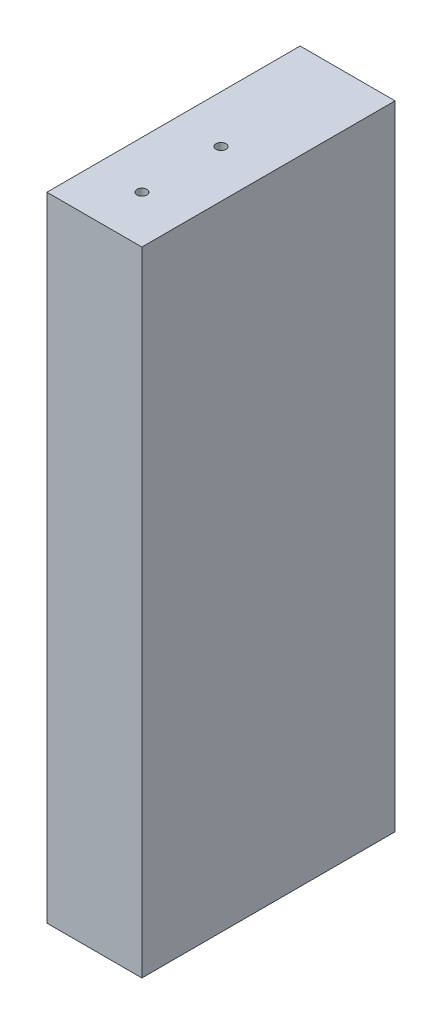
ISO-10303-21;
HEADER;
FILE_DESCRIPTION(('STEP AP214'),'2;1');
FILE_NAME('part.step','',(''),(''),'','','');
FILE_SCHEMA(('AUTOMOTIVE_DESIGN { 1 0 10303 214 1 1 1 1 }'));
ENDSEC;
DATA;
#1=APPLICATION_CONTEXT('core data for automotive mechanical design processes');
#2=APPLICATION_PROTOCOL_DEFINITION('international standard','automotive_design',2000,#1);
#3=PRODUCT_CONTEXT('',#1,'mechanical');
#4=PRODUCT('Part','Part','',(#3));
#5=PRODUCT_RELATED_PRODUCT_CATEGORY('part','',(#4));
#6=PRODUCT_DEFINITION_FORMATION('','',#4);
#7=PRODUCT_DEFINITION_CONTEXT('part definition',#1,'design');
#8=PRODUCT_DEFINITION('design','',#6,#7);
#9=PRODUCT_DEFINITION_SHAPE('','',#8);
#10=(LENGTH_UNIT() NAMED_UNIT(*) SI_UNIT(.MILLI.,.METRE.));
#11=(NAMED_UNIT(*) PLANE_ANGLE_UNIT() SI_UNIT($,.RADIAN.));
#12=(NAMED_UNIT(*) SI_UNIT($,.STERADIAN.) SOLID_ANGLE_UNIT());
#13=UNCERTAINTY_MEASURE_WITH_UNIT(LENGTH_MEASURE(1.E-05),#10,'distance_accuracy_value','');
#14=(GEOMETRIC_REPRESENTATION_CONTEXT(3) GLOBAL_UNCERTAINTY_ASSIGNED_CONTEXT((#13)) GLOBAL_UNIT_ASSIGNED_CONTEXT((#10,
#11,#12)) REPRESENTATION_CONTEXT('',''));
#15=CARTESIAN_POINT('',(0.,0.,0.));
#16=DIRECTION('',(0.,0.,1.));
#17=DIRECTION('',(1.,0.,0.));
#18=AXIS2_PLACEMENT_3D('',#15,#16,#17);
#19=CARTESIAN_POINT('',(386.66968064743,5942.63481881936,50.8));
#20=DIRECTION('',(-1.,0.,0.));
#21=DIRECTION('',(0.,0.,1.));
#22=AXIS2_PLACEMENT_3D('',#19,#20,#21);
#23=PLANE('',#22);
#24=DIRECTION('',(0.,1.,0.));
#25=VECTOR('',#24,1.);
#26=CARTESIAN_POINT('',(386.66968064743,5942.63481881936,0.));
#27=LINE('',#26,#25);
#28=CARTESIAN_POINT('',(386.66968064743,5942.63481881936,0.));
#29=VERTEX_POINT('',#28);
#30=CARTESIAN_POINT('',(386.66968064743,6069.63481870705,0.));
#31=VERTEX_POINT('',#30);
#32=EDGE_CURVE('E147',#29,#31,#27,.T.);
#33=ORIENTED_EDGE('',*,*,#32,.T.);
#34=DIRECTION('',(0.,0.,-1.));
#35=VECTOR('',#34,1.);
#36=CARTESIAN_POINT('',(386.66968064743,6069.63481870705,50.8));
#37=LINE('',#36,#35);
#38=CARTESIAN_POINT('',(386.66968064743,6069.63481870705,50.8));
#39=VERTEX_POINT('',#38);
#40=EDGE_CURVE('E11',#39,#31,#37,.T.);
#41=ORIENTED_EDGE('',*,*,#40,.F.);
#42=DIRECTION('',(0.,1.,0.));
#43=VECTOR('',#42,1.);
#44=CARTESIAN_POINT('',(386.66968064743,5942.63481881936,50.8));
#45=LINE('',#44,#43);
#46=CARTESIAN_POINT('',(386.66968064743,5942.63481881936,50.8));
#47=VERTEX_POINT('',#46);
#48=EDGE_CURVE('E140',#47,#39,#45,.T.);
#49=ORIENTED_EDGE('',*,*,#48,.F.);
#50=DIRECTION('',(0.,0.,-1.));
#51=VECTOR('',#50,1.);
#52=CARTESIAN_POINT('',(386.66968064743,5942.63481881936,50.8));
#53=LINE('',#52,#51);
#54=EDGE_CURVE('E146',#47,#29,#53,.T.);
#55=ORIENTED_EDGE('',*,*,#54,.T.);
#56=EDGE_LOOP('',(#33,#41,#49,#55));
#57=FACE_BOUND('',#56,.T.);
#58=ADVANCED_FACE('F32',(#57),#23,.F.);
#59=CARTESIAN_POINT('',(386.66968064743,6069.63481870705,50.8));
#60=DIRECTION('',(0.,-1.,0.));
#61=DIRECTION('',(0.,0.,-1.));
#62=AXIS2_PLACEMENT_3D('',#59,#60,#61);
#63=PLANE('',#62);
#64=CARTESIAN_POINT('',(377.144680647431,6069.63481870705,41.2749979606772));
#65=DIRECTION('',(0.,1.,0.));
#66=DIRECTION('',(0.,0.,1.));
#67=AXIS2_PLACEMENT_3D('',#64,#65,#66);
#68=CIRCLE('',#67,0.992251);
#69=CARTESIAN_POINT('',(377.144680647431,6069.63481870705,42.2672489606772));
#70=VERTEX_POINT('',#69);
#71=EDGE_CURVE('E111',#70,#70,#68,.T.);
#72=ORIENTED_EDGE('',*,*,#71,.F.);
#73=EDGE_LOOP('',(#72));
#74=FACE_BOUND('',#73,.T.);
#75=CARTESIAN_POINT('',(377.144680647431,6069.63481870705,25.3999979606774));
#76=DIRECTION('',(0.,1.,0.));
#77=DIRECTION('',(0.,0.,1.));
#78=AXIS2_PLACEMENT_3D('',#75,#76,#77);
#79=CIRCLE('',#78,0.992251);
#80=CARTESIAN_POINT('',(377.144680647431,6069.63481870705,26.3922489606774));
#81=VERTEX_POINT('',#80);
#82=EDGE_CURVE('E110',#81,#81,#79,.T.);
#83=ORIENTED_EDGE('',*,*,#82,.F.);
#84=EDGE_LOOP('',(#83));
#85=FACE_BOUND('',#84,.T.);
#86=DIRECTION('',(-1.,0.,0.));
#87=VECTOR('',#86,1.);
#88=CARTESIAN_POINT('',(386.66968064743,6069.63481870705,0.));
#89=LINE('',#88,#87);
#90=CARTESIAN_POINT('',(367.61968064743,6069.63481870705,0.));
#91=VERTEX_POINT('',#90);
#92=EDGE_CURVE('E150',#31,#91,#89,.T.);
#93=ORIENTED_EDGE('',*,*,#92,.T.);
#94=DIRECTION('',(0.,0.,-1.));
#95=VECTOR('',#94,1.);
#96=CARTESIAN_POINT('',(367.61968064743,6069.63481870705,50.8));
#97=LINE('',#96,#95);
#98=CARTESIAN_POINT('',(367.61968064743,6069.63481870705,50.8));
#99=VERTEX_POINT('',#98);
#100=EDGE_CURVE('E41',#99,#91,#97,.T.);
#101=ORIENTED_EDGE('',*,*,#100,.F.);
#102=DIRECTION('',(-1.,0.,0.));
#103=VECTOR('',#102,1.);
#104=CARTESIAN_POINT('',(386.66968064743,6069.63481870705,50.8));
#105=LINE('',#104,#103);
#106=EDGE_CURVE('E81',#39,#99,#105,.T.);
#107=ORIENTED_EDGE('',*,*,#106,.F.);
#108=ORIENTED_EDGE('',*,*,#40,.T.);
#109=EDGE_LOOP('',(#93,#101,#107,#108));
#110=FACE_BOUND('',#109,.T.);
#111=ADVANCED_FACE('F181',(#74,#85,#110),#63,.F.);
#112=CARTESIAN_POINT('',(367.61968064743,5942.63481881936,50.8));
#113=DIRECTION('',(1.,0.,0.));
#114=DIRECTION('',(0.,0.,-1.));
#115=AXIS2_PLACEMENT_3D('',#112,#113,#114);
#116=PLANE('',#115);
#117=DIRECTION('',(0.,-1.,0.));
#118=VECTOR('',#117,1.);
#119=CARTESIAN_POINT('',(367.61968064743,5942.63481881936,0.));
#120=LINE('',#119,#118);
#121=CARTESIAN_POINT('',(367.61968064743,5942.63481881936,0.));
#122=VERTEX_POINT('',#121);
#123=EDGE_CURVE('E68',#91,#122,#120,.T.);
#124=ORIENTED_EDGE('',*,*,#123,.T.);
#125=DIRECTION('',(0.,0.,-1.));
#126=VECTOR('',#125,1.);
#127=CARTESIAN_POINT('',(367.61968064743,5942.63481881936,50.8));
#128=LINE('',#127,#126);
#129=CARTESIAN_POINT('',(367.61968064743,5942.63481881936,50.8));
#130=VERTEX_POINT('',#129);
#131=EDGE_CURVE('E155',#130,#122,#128,.T.);
#132=ORIENTED_EDGE('',*,*,#131,.F.);
#133=DIRECTION('',(0.,-1.,0.));
#134=VECTOR('',#133,1.);
#135=CARTESIAN_POINT('',(367.61968064743,5942.63481881936,50.8));
#136=LINE('',#135,#134);
#137=EDGE_CURVE('E143',#99,#130,#136,.T.);
#138=ORIENTED_EDGE('',*,*,#137,.F.);
#139=ORIENTED_EDGE('',*,*,#100,.T.);
#140=EDGE_LOOP('',(#124,#132,#138,#139));
#141=FACE_BOUND('',#140,.T.);
#142=ADVANCED_FACE('F186',(#141),#116,.F.);
#143=CARTESIAN_POINT('',(386.66968064743,5942.63481881936,50.8));
#144=DIRECTION('',(0.,1.,0.));
#145=DIRECTION('',(0.,0.,1.));
#146=AXIS2_PLACEMENT_3D('',#143,#144,#145);
#147=PLANE('',#146);
#148=CARTESIAN_POINT('',(377.144680647431,5942.63481881936,41.2749979606772));
#149=DIRECTION('',(0.,-1.,0.));
#150=DIRECTION('',(0.,0.,-1.));
#151=AXIS2_PLACEMENT_3D('',#148,#149,#150);
#152=CIRCLE('',#151,0.992251);
#153=CARTESIAN_POINT('',(377.144680647431,5942.63481881936,40.2827469606772));
#154=VERTEX_POINT('',#153);
#155=EDGE_CURVE('E121',#154,#154,#152,.T.);
#156=ORIENTED_EDGE('',*,*,#155,.F.);
#157=EDGE_LOOP('',(#156));
#158=FACE_BOUND('',#157,.T.);
#159=CARTESIAN_POINT('',(377.144680647431,5942.63481881936,25.3999979606774));
#160=DIRECTION('',(0.,-1.,0.));
#161=DIRECTION('',(0.,0.,-1.));
#162=AXIS2_PLACEMENT_3D('',#159,#160,#161);
#163=CIRCLE('',#162,0.992251);
#164=CARTESIAN_POINT('',(377.144680647431,5942.63481881936,24.4077469606774));
#165=VERTEX_POINT('',#164);
#166=EDGE_CURVE('E127',#165,#165,#163,.T.);
#167=ORIENTED_EDGE('',*,*,#166,.F.);
#168=EDGE_LOOP('',(#167));
#169=FACE_BOUND('',#168,.T.);
#170=DIRECTION('',(1.,0.,0.));
#171=VECTOR('',#170,1.);
#172=CARTESIAN_POINT('',(386.66968064743,5942.63481881936,0.));
#173=LINE('',#172,#171);
#174=EDGE_CURVE('E74',#122,#29,#173,.T.);
#175=ORIENTED_EDGE('',*,*,#174,.T.);
#176=ORIENTED_EDGE('',*,*,#54,.F.);
#177=DIRECTION('',(1.,0.,0.));
#178=VECTOR('',#177,1.);
#179=CARTESIAN_POINT('',(386.66968064743,5942.63481881936,50.8));
#180=LINE('',#179,#178);
#181=EDGE_CURVE('E50',#130,#47,#180,.T.);
#182=ORIENTED_EDGE('',*,*,#181,.F.);
#183=ORIENTED_EDGE('',*,*,#131,.T.);
#184=EDGE_LOOP('',(#175,#176,#182,#183));
#185=FACE_BOUND('',#184,.T.);
#186=ADVANCED_FACE('F193',(#158,#169,#185),#147,.F.);
#187=CARTESIAN_POINT('',(0.,0.,50.8));
#188=DIRECTION('',(0.,0.,1.));
#189=DIRECTION('',(1.,0.,0.));
#190=AXIS2_PLACEMENT_3D('',#187,#188,#189);
#191=PLANE('',#190);
#192=ORIENTED_EDGE('',*,*,#48,.T.);
#193=ORIENTED_EDGE('',*,*,#106,.T.);
#194=ORIENTED_EDGE('',*,*,#137,.T.);
#195=ORIENTED_EDGE('',*,*,#181,.T.);
#196=EDGE_LOOP('',(#192,#193,#194,#195));
#197=FACE_BOUND('',#196,.T.);
#198=ADVANCED_FACE('F175',(#197),#191,.T.);
#199=CARTESIAN_POINT('',(0.,0.,0.));
#200=DIRECTION('',(0.,0.,1.));
#201=DIRECTION('',(1.,0.,0.));
#202=AXIS2_PLACEMENT_3D('',#199,#200,#201);
#203=PLANE('',#202);
#204=CARTESIAN_POINT('',(377.14468064743,6044.23481876321,0.));
#205=DIRECTION('',(0.,0.,1.));
#206=DIRECTION('',(1.,0.,0.));
#207=AXIS2_PLACEMENT_3D('',#204,#205,#206);
#208=CIRCLE('',#207,0.992251);
#209=CARTESIAN_POINT('',(378.13693164743,6044.23481876321,0.));
#210=VERTEX_POINT('',#209);
#211=EDGE_CURVE('E35',#210,#210,#208,.T.);
#212=ORIENTED_EDGE('',*,*,#211,.T.);
#213=EDGE_LOOP('',(#212));
#214=FACE_BOUND('',#213,.T.);
#215=CARTESIAN_POINT('',(377.14468064743,5968.03481876321,0.));
#216=DIRECTION('',(0.,0.,1.));
#217=DIRECTION('',(1.,0.,0.));
#218=AXIS2_PLACEMENT_3D('',#215,#216,#217);
#219=CIRCLE('',#218,0.992251);
#220=CARTESIAN_POINT('',(378.13693164743,5968.03481876321,0.));
#221=VERTEX_POINT('',#220);
#222=EDGE_CURVE('E139',#221,#221,#219,.T.);
#223=ORIENTED_EDGE('',*,*,#222,.T.);
#224=EDGE_LOOP('',(#223));
#225=FACE_BOUND('',#224,.T.);
#226=ORIENTED_EDGE('',*,*,#32,.F.);
#227=ORIENTED_EDGE('',*,*,#174,.F.);
#228=ORIENTED_EDGE('',*,*,#123,.F.);
#229=ORIENTED_EDGE('',*,*,#92,.F.);
#230=EDGE_LOOP('',(#226,#227,#228,#229));
#231=FACE_BOUND('',#230,.T.);
#232=ADVANCED_FACE('F160',(#214,#225,#231),#203,.F.);
#233=CARTESIAN_POINT('',(377.14468064743,5968.03481876583,-19.0500867729428));
#234=DIRECTION('',(0.,1.37705073334418E-10,-1.));
#235=DIRECTION('',(0.,1.,1.37705073334418E-10));
#236=AXIS2_PLACEMENT_3D('',#233,#234,#235);
#237=CYLINDRICAL_SURFACE('',#236,0.992251);
#238=CARTESIAN_POINT('',(377.14468064743,5968.03481876058,19.0499132270572));
#239=DIRECTION('',(0.,1.37705073334418E-10,-1.));
#240=DIRECTION('',(0.,1.,1.37705073334418E-10));
#241=AXIS2_PLACEMENT_3D('',#238,#239,#240);
#242=CIRCLE('',#241,0.992251);
#243=CARTESIAN_POINT('',(377.14468064743,5969.02706976058,19.0499132271939));
#244=VERTEX_POINT('',#243);
#245=EDGE_CURVE('E136',#244,#244,#242,.T.);
#246=ORIENTED_EDGE('',*,*,#245,.F.);
#247=EDGE_LOOP('',(#246));
#248=FACE_BOUND('',#247,.T.);
#249=ORIENTED_EDGE('',*,*,#222,.F.);
#250=EDGE_LOOP('',(#249));
#251=FACE_BOUND('',#250,.T.);
#252=ADVANCED_FACE('F163',(#248,#251),#237,.F.);
#253=CARTESIAN_POINT('',(377.14468064743,5968.03481876058,19.0499132270572));
#254=DIRECTION('',(0.,1.37705073334418E-10,-1.));
#255=DIRECTION('',(0.,1.,1.37705073334418E-10));
#256=AXIS2_PLACEMENT_3D('',#253,#254,#255);
#257=CONICAL_SURFACE('',#256,0.992251,1.02974425867666);
#258=CARTESIAN_POINT('',(377.14468064743,5968.0348187605,19.6461177771479));
#259=VERTEX_POINT('',#258);
#260=VERTEX_LOOP('',#259);
#261=FACE_BOUND('',#260,.T.);
#262=ORIENTED_EDGE('',*,*,#245,.T.);
#263=EDGE_LOOP('',(#262));
#264=FACE_BOUND('',#263,.T.);
#265=ADVANCED_FACE('F165',(#261,#264),#257,.F.);
#266=CARTESIAN_POINT('',(377.14468064743,6044.23481876583,-19.0500867624496));
#267=DIRECTION('',(0.,1.37705073334418E-10,-1.));
#268=DIRECTION('',(0.,1.,1.37705073334418E-10));
#269=AXIS2_PLACEMENT_3D('',#266,#267,#268);
#270=CYLINDRICAL_SURFACE('',#269,0.992251);
#271=CARTESIAN_POINT('',(377.14468064743,6044.23481876058,19.0499132375503));
#272=DIRECTION('',(0.,1.37705073334418E-10,-1.));
#273=DIRECTION('',(0.,1.,1.37705073334418E-10));
#274=AXIS2_PLACEMENT_3D('',#271,#272,#273);
#275=CIRCLE('',#274,0.992251);
#276=CARTESIAN_POINT('',(377.14468064743,6045.22706976058,19.049913237687));
#277=VERTEX_POINT('',#276);
#278=EDGE_CURVE('E133',#277,#277,#275,.T.);
#279=ORIENTED_EDGE('',*,*,#278,.F.);
#280=EDGE_LOOP('',(#279));
#281=FACE_BOUND('',#280,.T.);
#282=ORIENTED_EDGE('',*,*,#211,.F.);
#283=EDGE_LOOP('',(#282));
#284=FACE_BOUND('',#283,.T.);
#285=ADVANCED_FACE('F172',(#281,#284),#270,.F.);
#286=CARTESIAN_POINT('',(377.14468064743,6044.23481876058,19.0499132375503));
#287=DIRECTION('',(0.,1.37705073334418E-10,-1.));
#288=DIRECTION('',(0.,1.,1.37705073334418E-10));
#289=AXIS2_PLACEMENT_3D('',#286,#287,#288);
#290=CONICAL_SURFACE('',#289,0.992251,1.02974425867666);
#291=CARTESIAN_POINT('',(377.14468064743,6044.2348187605,19.6461177876411));
#292=VERTEX_POINT('',#291);
#293=VERTEX_LOOP('',#292);
#294=FACE_BOUND('',#293,.T.);
#295=ORIENTED_EDGE('',*,*,#278,.T.);
#296=EDGE_LOOP('',(#295));
#297=FACE_BOUND('',#296,.T.);
#298=ADVANCED_FACE('F217',(#294,#297),#290,.F.);
#299=CARTESIAN_POINT('',(377.144680647431,5961.68481881936,25.3999979606774));
#300=DIRECTION('',(0.,-1.,0.));
#301=DIRECTION('',(0.,0.,-1.));
#302=AXIS2_PLACEMENT_3D('',#299,#300,#301);
#303=CONICAL_SURFACE('',#302,0.992251,1.02974425867684);
#304=CARTESIAN_POINT('',(377.144680647431,5962.28102336945,25.3999979606774));
#305=VERTEX_POINT('',#304);
#306=VERTEX_LOOP('',#305);
#307=FACE_BOUND('',#306,.T.);
#308=CARTESIAN_POINT('',(377.144680647431,5961.68481881936,25.3999979606774));
#309=DIRECTION('',(0.,-1.,0.));
#310=DIRECTION('',(0.,0.,-1.));
#311=AXIS2_PLACEMENT_3D('',#308,#309,#310);
#312=CIRCLE('',#311,0.992251);
#313=CARTESIAN_POINT('',(377.144680647431,5961.68481881936,24.4077469606774));
#314=VERTEX_POINT('',#313);
#315=EDGE_CURVE('E130',#314,#314,#312,.T.);
#316=ORIENTED_EDGE('',*,*,#315,.T.);
#317=EDGE_LOOP('',(#316));
#318=FACE_BOUND('',#317,.T.);
#319=ADVANCED_FACE('F222',(#307,#318),#303,.F.);
#320=CARTESIAN_POINT('',(377.144680647431,5942.63481881936,25.3999979606774));
#321=DIRECTION('',(0.,-1.,0.));
#322=DIRECTION('',(0.,0.,-1.));
#323=AXIS2_PLACEMENT_3D('',#320,#321,#322);
#324=CYLINDRICAL_SURFACE('',#323,0.992251);
#325=ORIENTED_EDGE('',*,*,#315,.F.);
#326=EDGE_LOOP('',(#325));
#327=FACE_BOUND('',#326,.T.);
#328=ORIENTED_EDGE('',*,*,#166,.T.);
#329=EDGE_LOOP('',(#328));
#330=FACE_BOUND('',#329,.T.);
#331=ADVANCED_FACE('F227',(#327,#330),#324,.F.);
#332=CARTESIAN_POINT('',(377.144680647431,5961.68481881936,41.2749979606772));
#333=DIRECTION('',(0.,-1.,0.));
#334=DIRECTION('',(0.,0.,-1.));
#335=AXIS2_PLACEMENT_3D('',#332,#333,#334);
#336=CONICAL_SURFACE('',#335,0.992251,1.02974425867684);
#337=CARTESIAN_POINT('',(377.144680647431,5962.28102336945,41.2749979606772));
#338=VERTEX_POINT('',#337);
#339=VERTEX_LOOP('',#338);
#340=FACE_BOUND('',#339,.T.);
#341=CARTESIAN_POINT('',(377.144680647431,5961.68481881936,41.2749979606772));
#342=DIRECTION('',(0.,-1.,0.));
#343=DIRECTION('',(0.,0.,-1.));
#344=AXIS2_PLACEMENT_3D('',#341,#342,#343);
#345=CIRCLE('',#344,0.992251);
#346=CARTESIAN_POINT('',(377.144680647431,5961.68481881936,40.2827469606772));
#347=VERTEX_POINT('',#346);
#348=EDGE_CURVE('E124',#347,#347,#345,.T.);
#349=ORIENTED_EDGE('',*,*,#348,.T.);
#350=EDGE_LOOP('',(#349));
#351=FACE_BOUND('',#350,.T.);
#352=ADVANCED_FACE('F237',(#340,#351),#336,.F.);
#353=CARTESIAN_POINT('',(377.144680647431,5942.63481881936,41.2749979606772));
#354=DIRECTION('',(0.,-1.,0.));
#355=DIRECTION('',(0.,0.,-1.));
#356=AXIS2_PLACEMENT_3D('',#353,#354,#355);
#357=CYLINDRICAL_SURFACE('',#356,0.992251);
#358=ORIENTED_EDGE('',*,*,#348,.F.);
#359=EDGE_LOOP('',(#358));
#360=FACE_BOUND('',#359,.T.);
#361=ORIENTED_EDGE('',*,*,#155,.T.);
#362=EDGE_LOOP('',(#361));
#363=FACE_BOUND('',#362,.T.);
#364=ADVANCED_FACE('F247',(#360,#363),#357,.F.);
#365=CARTESIAN_POINT('',(377.144680647431,6050.58481870705,25.3999979606774));
#366=DIRECTION('',(0.,1.,0.));
#367=DIRECTION('',(0.,0.,1.));
#368=AXIS2_PLACEMENT_3D('',#365,#366,#367);
#369=CONICAL_SURFACE('',#368,0.992251,1.02974425867684);
#370=CARTESIAN_POINT('',(377.144680647431,6049.98861415696,25.3999979606774));
#371=VERTEX_POINT('',#370);
#372=VERTEX_LOOP('',#371);
#373=FACE_BOUND('',#372,.T.);
#374=CARTESIAN_POINT('',(377.144680647431,6050.58481870705,25.3999979606774));
#375=DIRECTION('',(0.,1.,0.));
#376=DIRECTION('',(0.,0.,1.));
#377=AXIS2_PLACEMENT_3D('',#374,#375,#376);
#378=CIRCLE('',#377,0.992251);
#379=CARTESIAN_POINT('',(377.144680647431,6050.58481870705,26.3922489606774));
#380=VERTEX_POINT('',#379);
#381=EDGE_CURVE('E114',#380,#380,#378,.T.);
#382=ORIENTED_EDGE('',*,*,#381,.T.);
#383=EDGE_LOOP('',(#382));
#384=FACE_BOUND('',#383,.T.);
#385=ADVANCED_FACE('F256',(#373,#384),#369,.F.);
#386=CARTESIAN_POINT('',(377.144680647431,6069.63481870705,25.3999979606774));
#387=DIRECTION('',(0.,1.,0.));
#388=DIRECTION('',(0.,0.,1.));
#389=AXIS2_PLACEMENT_3D('',#386,#387,#388);
#390=CYLINDRICAL_SURFACE('',#389,0.992251);
#391=ORIENTED_EDGE('',*,*,#381,.F.);
#392=EDGE_LOOP('',(#391));
#393=FACE_BOUND('',#392,.T.);
#394=ORIENTED_EDGE('',*,*,#82,.T.);
#395=EDGE_LOOP('',(#394));
#396=FACE_BOUND('',#395,.T.);
#397=ADVANCED_FACE('F104',(#393,#396),#390,.F.);
#398=CARTESIAN_POINT('',(377.144680647431,6050.58481870705,41.2749979606772));
#399=DIRECTION('',(0.,1.,0.));
#400=DIRECTION('',(0.,0.,1.));
#401=AXIS2_PLACEMENT_3D('',#398,#399,#400);
#402=CONICAL_SURFACE('',#401,0.992251,1.02974425867684);
#403=CARTESIAN_POINT('',(377.144680647431,6049.98861415696,41.2749979606772));
#404=VERTEX_POINT('',#403);
#405=VERTEX_LOOP('',#404);
#406=FACE_BOUND('',#405,.T.);
#407=CARTESIAN_POINT('',(377.144680647431,6050.58481870705,41.2749979606772));
#408=DIRECTION('',(0.,1.,0.));
#409=DIRECTION('',(0.,0.,1.));
#410=AXIS2_PLACEMENT_3D('',#407,#408,#409);
#411=CIRCLE('',#410,0.992251);
#412=CARTESIAN_POINT('',(377.144680647431,6050.58481870705,42.2672489606772));
#413=VERTEX_POINT('',#412);
#414=EDGE_CURVE('E108',#413,#413,#411,.T.);
#415=ORIENTED_EDGE('',*,*,#414,.T.);
#416=EDGE_LOOP('',(#415));
#417=FACE_BOUND('',#416,.T.);
#418=ADVANCED_FACE('F100',(#406,#417),#402,.F.);
#419=CARTESIAN_POINT('',(377.144680647431,6069.63481870705,41.2749979606772));
#420=DIRECTION('',(0.,1.,0.));
#421=DIRECTION('',(0.,0.,1.));
#422=AXIS2_PLACEMENT_3D('',#419,#420,#421);
#423=CYLINDRICAL_SURFACE('',#422,0.992251);
#424=ORIENTED_EDGE('',*,*,#414,.F.);
#425=EDGE_LOOP('',(#424));
#426=FACE_BOUND('',#425,.T.);
#427=ORIENTED_EDGE('',*,*,#71,.T.);
#428=EDGE_LOOP('',(#427));
#429=FACE_BOUND('',#428,.T.);
#430=ADVANCED_FACE('F103',(#426,#429),#423,.F.);
#431=CLOSED_SHELL('',(#58,#111,#142,#186,#198,#232,#252,#265,#285,#298,#319,#331,#352,#364,#385,
#397,#418,#430));
#432=MANIFOLD_SOLID_BREP('B2',#431);
#433=ADVANCED_BREP_SHAPE_REPRESENTATION('',(#18,#432),#14);
#434=SHAPE_DEFINITION_REPRESENTATION(#9,#433);
ENDSEC;
END-ISO-10303-21;
